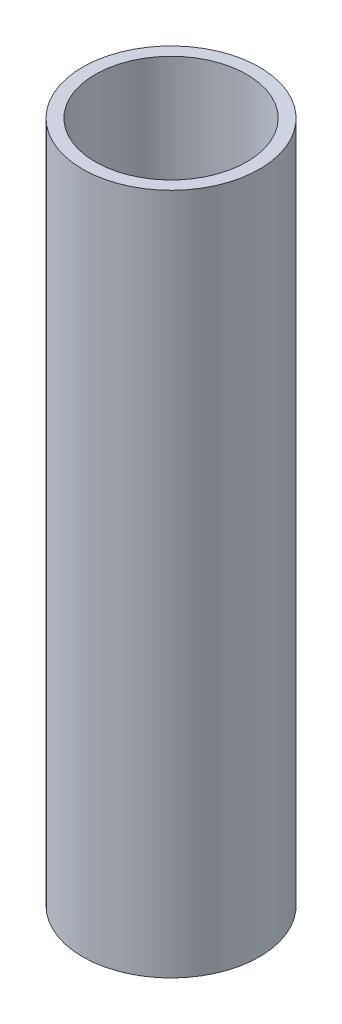
ISO-10303-21;
HEADER;
FILE_DESCRIPTION(('STEP AP214'),'2;1');
FILE_NAME('part.step','',(''),(''),'','','');
FILE_SCHEMA(('AUTOMOTIVE_DESIGN { 1 0 10303 214 1 1 1 1 }'));
ENDSEC;
DATA;
#1=APPLICATION_CONTEXT('core data for automotive mechanical design processes');
#2=APPLICATION_PROTOCOL_DEFINITION('international standard','automotive_design',2000,#1);
#3=PRODUCT_CONTEXT('',#1,'mechanical');
#4=PRODUCT('Part','Part','',(#3));
#5=PRODUCT_RELATED_PRODUCT_CATEGORY('part','',(#4));
#6=PRODUCT_DEFINITION_FORMATION('','',#4);
#7=PRODUCT_DEFINITION_CONTEXT('part definition',#1,'design');
#8=PRODUCT_DEFINITION('design','',#6,#7);
#9=PRODUCT_DEFINITION_SHAPE('','',#8);
#10=(LENGTH_UNIT() NAMED_UNIT(*) SI_UNIT(.MILLI.,.METRE.));
#11=(NAMED_UNIT(*) PLANE_ANGLE_UNIT() SI_UNIT($,.RADIAN.));
#12=(NAMED_UNIT(*) SI_UNIT($,.STERADIAN.) SOLID_ANGLE_UNIT());
#13=UNCERTAINTY_MEASURE_WITH_UNIT(LENGTH_MEASURE(1.E-05),#10,'distance_accuracy_value','');
#14=(GEOMETRIC_REPRESENTATION_CONTEXT(3) GLOBAL_UNCERTAINTY_ASSIGNED_CONTEXT((#13)) GLOBAL_UNIT_ASSIGNED_CONTEXT((#10,
#11,#12)) REPRESENTATION_CONTEXT('',''));
#15=CARTESIAN_POINT('',(0.,0.,0.));
#16=DIRECTION('',(0.,0.,1.));
#17=DIRECTION('',(1.,0.,0.));
#18=AXIS2_PLACEMENT_3D('',#15,#16,#17);
#19=CARTESIAN_POINT('',(0.,342.9,0.));
#20=DIRECTION('',(0.,1.,0.));
#21=DIRECTION('',(0.,0.,1.));
#22=AXIS2_PLACEMENT_3D('',#19,#20,#21);
#23=PLANE('',#22);
#24=CARTESIAN_POINT('',(0.,342.9,0.));
#25=DIRECTION('',(0.,1.,0.));
#26=DIRECTION('',(0.,0.,1.));
#27=AXIS2_PLACEMENT_3D('',#24,#25,#26);
#28=CIRCLE('',#27,44.45);
#29=CARTESIAN_POINT('',(0.,342.9,44.45));
#30=VERTEX_POINT('',#29);
#31=EDGE_CURVE('E10',#30,#30,#28,.T.);
#32=ORIENTED_EDGE('',*,*,#31,.T.);
#33=EDGE_LOOP('',(#32));
#34=FACE_BOUND('',#33,.T.);
#35=CARTESIAN_POINT('',(0.,342.9,0.));
#36=DIRECTION('',(0.,1.,0.));
#37=DIRECTION('',(0.,0.,1.));
#38=AXIS2_PLACEMENT_3D('',#35,#36,#37);
#39=CIRCLE('',#38,38.1);
#40=CARTESIAN_POINT('',(0.,342.9,38.1));
#41=VERTEX_POINT('',#40);
#42=EDGE_CURVE('E46',#41,#41,#39,.T.);
#43=ORIENTED_EDGE('',*,*,#42,.F.);
#44=EDGE_LOOP('',(#43));
#45=FACE_BOUND('',#44,.T.);
#46=ADVANCED_FACE('F35',(#34,#45),#23,.T.);
#47=CARTESIAN_POINT('',(0.,0.,0.));
#48=DIRECTION('',(0.,1.,0.));
#49=DIRECTION('',(0.,0.,1.));
#50=AXIS2_PLACEMENT_3D('',#47,#48,#49);
#51=PLANE('',#50);
#52=CARTESIAN_POINT('',(0.,0.,0.));
#53=DIRECTION('',(0.,1.,0.));
#54=DIRECTION('',(0.,0.,1.));
#55=AXIS2_PLACEMENT_3D('',#52,#53,#54);
#56=CIRCLE('',#55,44.45);
#57=CARTESIAN_POINT('',(0.,0.,44.45));
#58=VERTEX_POINT('',#57);
#59=EDGE_CURVE('E39',#58,#58,#56,.T.);
#60=ORIENTED_EDGE('',*,*,#59,.F.);
#61=EDGE_LOOP('',(#60));
#62=FACE_BOUND('',#61,.T.);
#63=CARTESIAN_POINT('',(0.,0.,0.));
#64=DIRECTION('',(0.,1.,0.));
#65=DIRECTION('',(0.,0.,1.));
#66=AXIS2_PLACEMENT_3D('',#63,#64,#65);
#67=CIRCLE('',#66,38.1);
#68=CARTESIAN_POINT('',(0.,0.,38.1));
#69=VERTEX_POINT('',#68);
#70=EDGE_CURVE('E48',#69,#69,#67,.T.);
#71=ORIENTED_EDGE('',*,*,#70,.T.);
#72=EDGE_LOOP('',(#71));
#73=FACE_BOUND('',#72,.T.);
#74=ADVANCED_FACE('F58',(#62,#73),#51,.F.);
#75=CARTESIAN_POINT('',(0.,342.9,0.));
#76=DIRECTION('',(0.,-1.,0.));
#77=DIRECTION('',(0.,0.,-1.));
#78=AXIS2_PLACEMENT_3D('',#75,#76,#77);
#79=CYLINDRICAL_SURFACE('',#78,44.45);
#80=ORIENTED_EDGE('',*,*,#31,.F.);
#81=EDGE_LOOP('',(#80));
#82=FACE_BOUND('',#81,.T.);
#83=ORIENTED_EDGE('',*,*,#59,.T.);
#84=EDGE_LOOP('',(#83));
#85=FACE_BOUND('',#84,.T.);
#86=ADVANCED_FACE('F37',(#82,#85),#79,.T.);
#87=CARTESIAN_POINT('',(0.,342.9,0.));
#88=DIRECTION('',(0.,-1.,0.));
#89=DIRECTION('',(0.,0.,-1.));
#90=AXIS2_PLACEMENT_3D('',#87,#88,#89);
#91=CYLINDRICAL_SURFACE('',#90,38.1);
#92=ORIENTED_EDGE('',*,*,#42,.T.);
#93=EDGE_LOOP('',(#92));
#94=FACE_BOUND('',#93,.T.);
#95=ORIENTED_EDGE('',*,*,#70,.F.);
#96=EDGE_LOOP('',(#95));
#97=FACE_BOUND('',#96,.T.);
#98=ADVANCED_FACE('F54',(#94,#97),#91,.F.);
#99=CLOSED_SHELL('',(#46,#74,#86,#98));
#100=MANIFOLD_SOLID_BREP('B2',#99);
#101=ADVANCED_BREP_SHAPE_REPRESENTATION('',(#18,#100),#14);
#102=SHAPE_DEFINITION_REPRESENTATION(#9,#101);
ENDSEC;
END-ISO-10303-21;
